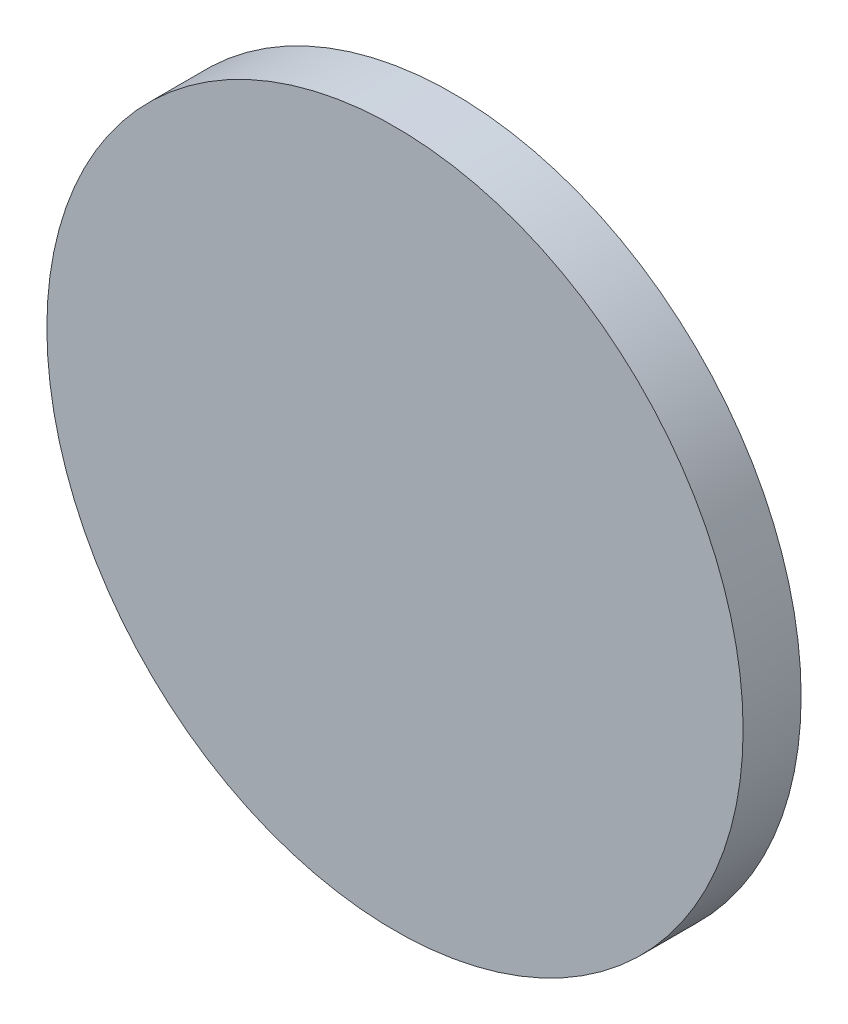
ISO-10303-21;
HEADER;
FILE_DESCRIPTION(('STEP AP214'),'2;1');
FILE_NAME('part.step','',(''),(''),'','','');
FILE_SCHEMA(('AUTOMOTIVE_DESIGN { 1 0 10303 214 1 1 1 1 }'));
ENDSEC;
DATA;
#1=APPLICATION_CONTEXT('core data for automotive mechanical design processes');
#2=APPLICATION_PROTOCOL_DEFINITION('international standard','automotive_design',2000,#1);
#3=PRODUCT_CONTEXT('',#1,'mechanical');
#4=PRODUCT('Part','Part','',(#3));
#5=PRODUCT_RELATED_PRODUCT_CATEGORY('part','',(#4));
#6=PRODUCT_DEFINITION_FORMATION('','',#4);
#7=PRODUCT_DEFINITION_CONTEXT('part definition',#1,'design');
#8=PRODUCT_DEFINITION('design','',#6,#7);
#9=PRODUCT_DEFINITION_SHAPE('','',#8);
#10=(LENGTH_UNIT() NAMED_UNIT(*) SI_UNIT(.MILLI.,.METRE.));
#11=(NAMED_UNIT(*) PLANE_ANGLE_UNIT() SI_UNIT($,.RADIAN.));
#12=(NAMED_UNIT(*) SI_UNIT($,.STERADIAN.) SOLID_ANGLE_UNIT());
#13=UNCERTAINTY_MEASURE_WITH_UNIT(LENGTH_MEASURE(1.E-05),#10,'distance_accuracy_value','');
#14=(GEOMETRIC_REPRESENTATION_CONTEXT(3) GLOBAL_UNCERTAINTY_ASSIGNED_CONTEXT((#13)) GLOBAL_UNIT_ASSIGNED_CONTEXT((#10,
#11,#12)) REPRESENTATION_CONTEXT('',''));
#15=CARTESIAN_POINT('',(0.,0.,0.));
#16=DIRECTION('',(0.,0.,1.));
#17=DIRECTION('',(1.,0.,0.));
#18=AXIS2_PLACEMENT_3D('',#15,#16,#17);
#19=CARTESIAN_POINT('',(0.,0.,6.35));
#20=DIRECTION('',(0.,0.,-1.));
#21=DIRECTION('',(-1.,0.,0.));
#22=AXIS2_PLACEMENT_3D('',#19,#20,#21);
#23=CYLINDRICAL_SURFACE('',#22,38.1);
#24=CARTESIAN_POINT('',(0.,0.,6.35));
#25=DIRECTION('',(0.,0.,1.));
#26=DIRECTION('',(1.,0.,0.));
#27=AXIS2_PLACEMENT_3D('',#24,#25,#26);
#28=CIRCLE('',#27,38.1);
#29=CARTESIAN_POINT('',(38.1,0.,6.35));
#30=VERTEX_POINT('',#29);
#31=EDGE_CURVE('E10',#30,#30,#28,.T.);
#32=ORIENTED_EDGE('',*,*,#31,.F.);
#33=EDGE_LOOP('',(#32));
#34=FACE_BOUND('',#33,.T.);
#35=CARTESIAN_POINT('',(0.,0.,0.));
#36=DIRECTION('',(0.,0.,1.));
#37=DIRECTION('',(1.,0.,0.));
#38=AXIS2_PLACEMENT_3D('',#35,#36,#37);
#39=CIRCLE('',#38,38.1);
#40=CARTESIAN_POINT('',(38.1,0.,0.));
#41=VERTEX_POINT('',#40);
#42=EDGE_CURVE('E34',#41,#41,#39,.T.);
#43=ORIENTED_EDGE('',*,*,#42,.T.);
#44=EDGE_LOOP('',(#43));
#45=FACE_BOUND('',#44,.T.);
#46=ADVANCED_FACE('F31',(#34,#45),#23,.T.);
#47=CARTESIAN_POINT('',(0.,0.,6.35));
#48=DIRECTION('',(0.,0.,1.));
#49=DIRECTION('',(1.,0.,0.));
#50=AXIS2_PLACEMENT_3D('',#47,#48,#49);
#51=PLANE('',#50);
#52=ORIENTED_EDGE('',*,*,#31,.T.);
#53=EDGE_LOOP('',(#52));
#54=FACE_BOUND('',#53,.T.);
#55=ADVANCED_FACE('F46',(#54),#51,.T.);
#56=CARTESIAN_POINT('',(0.,0.,0.));
#57=DIRECTION('',(0.,0.,1.));
#58=DIRECTION('',(1.,0.,0.));
#59=AXIS2_PLACEMENT_3D('',#56,#57,#58);
#60=PLANE('',#59);
#61=ORIENTED_EDGE('',*,*,#42,.F.);
#62=EDGE_LOOP('',(#61));
#63=FACE_BOUND('',#62,.T.);
#64=ADVANCED_FACE('F44',(#63),#60,.F.);
#65=CLOSED_SHELL('',(#46,#55,#64));
#66=MANIFOLD_SOLID_BREP('B2',#65);
#67=ADVANCED_BREP_SHAPE_REPRESENTATION('',(#18,#66),#14);
#68=SHAPE_DEFINITION_REPRESENTATION(#9,#67);
ENDSEC;
END-ISO-10303-21;
